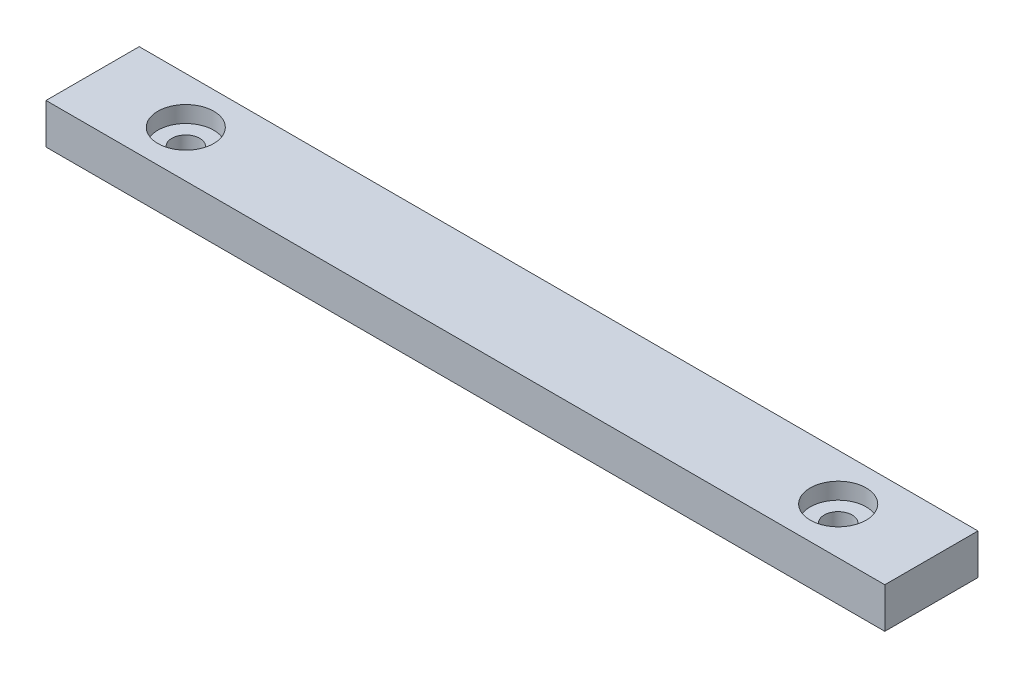
ISO-10303-21;
HEADER;
FILE_DESCRIPTION(('STEP AP214'),'2;1');
FILE_NAME('part.step','',(''),(''),'','','');
FILE_SCHEMA(('AUTOMOTIVE_DESIGN { 1 0 10303 214 1 1 1 1 }'));
ENDSEC;
DATA;
#1=APPLICATION_CONTEXT('core data for automotive mechanical design processes');
#2=APPLICATION_PROTOCOL_DEFINITION('international standard','automotive_design',2000,#1);
#3=PRODUCT_CONTEXT('',#1,'mechanical');
#4=PRODUCT('Part','Part','',(#3));
#5=PRODUCT_RELATED_PRODUCT_CATEGORY('part','',(#4));
#6=PRODUCT_DEFINITION_FORMATION('','',#4);
#7=PRODUCT_DEFINITION_CONTEXT('part definition',#1,'design');
#8=PRODUCT_DEFINITION('design','',#6,#7);
#9=PRODUCT_DEFINITION_SHAPE('','',#8);
#10=(LENGTH_UNIT() NAMED_UNIT(*) SI_UNIT(.MILLI.,.METRE.));
#11=(NAMED_UNIT(*) PLANE_ANGLE_UNIT() SI_UNIT($,.RADIAN.));
#12=(NAMED_UNIT(*) SI_UNIT($,.STERADIAN.) SOLID_ANGLE_UNIT());
#13=UNCERTAINTY_MEASURE_WITH_UNIT(LENGTH_MEASURE(1.E-05),#10,'distance_accuracy_value','');
#14=(GEOMETRIC_REPRESENTATION_CONTEXT(3) GLOBAL_UNCERTAINTY_ASSIGNED_CONTEXT((#13)) GLOBAL_UNIT_ASSIGNED_CONTEXT((#10,
#11,#12)) REPRESENTATION_CONTEXT('',''));
#15=CARTESIAN_POINT('',(0.,0.,0.));
#16=DIRECTION('',(0.,0.,1.));
#17=DIRECTION('',(1.,0.,0.));
#18=AXIS2_PLACEMENT_3D('',#15,#16,#17);
#19=CARTESIAN_POINT('',(135.,13.,15.));
#20=DIRECTION('',(-1.,0.,0.));
#21=DIRECTION('',(0.,0.,1.));
#22=AXIS2_PLACEMENT_3D('',#19,#20,#21);
#23=PLANE('',#22);
#24=DIRECTION('',(0.,0.,-1.));
#25=VECTOR('',#24,1.);
#26=CARTESIAN_POINT('',(135.,0.,15.));
#27=LINE('',#26,#25);
#28=CARTESIAN_POINT('',(135.,0.,15.));
#29=VERTEX_POINT('',#28);
#30=CARTESIAN_POINT('',(135.,0.,-15.));
#31=VERTEX_POINT('',#30);
#32=EDGE_CURVE('E110',#29,#31,#27,.T.);
#33=ORIENTED_EDGE('',*,*,#32,.T.);
#34=DIRECTION('',(0.,-1.,0.));
#35=VECTOR('',#34,1.);
#36=CARTESIAN_POINT('',(135.,13.,-15.));
#37=LINE('',#36,#35);
#38=CARTESIAN_POINT('',(135.,13.,-15.));
#39=VERTEX_POINT('',#38);
#40=EDGE_CURVE('E11',#39,#31,#37,.T.);
#41=ORIENTED_EDGE('',*,*,#40,.F.);
#42=DIRECTION('',(0.,0.,-1.));
#43=VECTOR('',#42,1.);
#44=CARTESIAN_POINT('',(135.,13.,15.));
#45=LINE('',#44,#43);
#46=CARTESIAN_POINT('',(135.,13.,15.));
#47=VERTEX_POINT('',#46);
#48=EDGE_CURVE('E93',#47,#39,#45,.T.);
#49=ORIENTED_EDGE('',*,*,#48,.F.);
#50=DIRECTION('',(0.,-1.,0.));
#51=VECTOR('',#50,1.);
#52=CARTESIAN_POINT('',(135.,13.,15.));
#53=LINE('',#52,#51);
#54=EDGE_CURVE('E106',#47,#29,#53,.T.);
#55=ORIENTED_EDGE('',*,*,#54,.T.);
#56=EDGE_LOOP('',(#33,#41,#49,#55));
#57=FACE_BOUND('',#56,.T.);
#58=ADVANCED_FACE('F39',(#57),#23,.F.);
#59=CARTESIAN_POINT('',(-135.,13.,-15.));
#60=DIRECTION('',(0.,0.,1.));
#61=DIRECTION('',(1.,0.,0.));
#62=AXIS2_PLACEMENT_3D('',#59,#60,#61);
#63=PLANE('',#62);
#64=DIRECTION('',(-1.,0.,0.));
#65=VECTOR('',#64,1.);
#66=CARTESIAN_POINT('',(-135.,0.,-15.));
#67=LINE('',#66,#65);
#68=CARTESIAN_POINT('',(-135.,0.,-15.));
#69=VERTEX_POINT('',#68);
#70=EDGE_CURVE('E98',#31,#69,#67,.T.);
#71=ORIENTED_EDGE('',*,*,#70,.T.);
#72=DIRECTION('',(0.,-1.,0.));
#73=VECTOR('',#72,1.);
#74=CARTESIAN_POINT('',(-135.,13.,-15.));
#75=LINE('',#74,#73);
#76=CARTESIAN_POINT('',(-135.,13.,-15.));
#77=VERTEX_POINT('',#76);
#78=EDGE_CURVE('E49',#77,#69,#75,.T.);
#79=ORIENTED_EDGE('',*,*,#78,.F.);
#80=DIRECTION('',(-1.,0.,0.));
#81=VECTOR('',#80,1.);
#82=CARTESIAN_POINT('',(-135.,13.,-15.));
#83=LINE('',#82,#81);
#84=EDGE_CURVE('E88',#39,#77,#83,.T.);
#85=ORIENTED_EDGE('',*,*,#84,.F.);
#86=ORIENTED_EDGE('',*,*,#40,.T.);
#87=EDGE_LOOP('',(#71,#79,#85,#86));
#88=FACE_BOUND('',#87,.T.);
#89=ADVANCED_FACE('F97',(#88),#63,.F.);
#90=CARTESIAN_POINT('',(-135.,13.,15.));
#91=DIRECTION('',(1.,0.,0.));
#92=DIRECTION('',(0.,0.,-1.));
#93=AXIS2_PLACEMENT_3D('',#90,#91,#92);
#94=PLANE('',#93);
#95=DIRECTION('',(0.,0.,1.));
#96=VECTOR('',#95,1.);
#97=CARTESIAN_POINT('',(-135.,0.,15.));
#98=LINE('',#97,#96);
#99=CARTESIAN_POINT('',(-135.,0.,15.));
#100=VERTEX_POINT('',#99);
#101=EDGE_CURVE('E75',#69,#100,#98,.T.);
#102=ORIENTED_EDGE('',*,*,#101,.T.);
#103=DIRECTION('',(0.,-1.,0.));
#104=VECTOR('',#103,1.);
#105=CARTESIAN_POINT('',(-135.,13.,15.));
#106=LINE('',#105,#104);
#107=CARTESIAN_POINT('',(-135.,13.,15.));
#108=VERTEX_POINT('',#107);
#109=EDGE_CURVE('E100',#108,#100,#106,.T.);
#110=ORIENTED_EDGE('',*,*,#109,.F.);
#111=DIRECTION('',(0.,0.,1.));
#112=VECTOR('',#111,1.);
#113=CARTESIAN_POINT('',(-135.,13.,15.));
#114=LINE('',#113,#112);
#115=EDGE_CURVE('E91',#77,#108,#114,.T.);
#116=ORIENTED_EDGE('',*,*,#115,.F.);
#117=ORIENTED_EDGE('',*,*,#78,.T.);
#118=EDGE_LOOP('',(#102,#110,#116,#117));
#119=FACE_BOUND('',#118,.T.);
#120=ADVANCED_FACE('F102',(#119),#94,.F.);
#121=CARTESIAN_POINT('',(-135.,13.,15.));
#122=DIRECTION('',(0.,0.,-1.));
#123=DIRECTION('',(-1.,0.,0.));
#124=AXIS2_PLACEMENT_3D('',#121,#122,#123);
#125=PLANE('',#124);
#126=DIRECTION('',(1.,0.,0.));
#127=VECTOR('',#126,1.);
#128=CARTESIAN_POINT('',(-135.,0.,15.));
#129=LINE('',#128,#127);
#130=EDGE_CURVE('E81',#100,#29,#129,.T.);
#131=ORIENTED_EDGE('',*,*,#130,.T.);
#132=ORIENTED_EDGE('',*,*,#54,.F.);
#133=DIRECTION('',(1.,0.,0.));
#134=VECTOR('',#133,1.);
#135=CARTESIAN_POINT('',(-135.,13.,15.));
#136=LINE('',#135,#134);
#137=EDGE_CURVE('E58',#108,#47,#136,.T.);
#138=ORIENTED_EDGE('',*,*,#137,.F.);
#139=ORIENTED_EDGE('',*,*,#109,.T.);
#140=EDGE_LOOP('',(#131,#132,#138,#139));
#141=FACE_BOUND('',#140,.T.);
#142=ADVANCED_FACE('F162',(#141),#125,.F.);
#143=CARTESIAN_POINT('',(0.,13.,0.));
#144=DIRECTION('',(0.,-1.,0.));
#145=DIRECTION('',(0.,0.,-1.));
#146=AXIS2_PLACEMENT_3D('',#143,#144,#145);
#147=PLANE('',#146);
#148=CARTESIAN_POINT('',(-105.,13.,0.));
#149=DIRECTION('',(0.,1.,0.));
#150=DIRECTION('',(0.,0.,1.));
#151=AXIS2_PLACEMENT_3D('',#148,#149,#150);
#152=CIRCLE('',#151,9.0055);
#153=CARTESIAN_POINT('',(-105.,13.,9.0055));
#154=VERTEX_POINT('',#153);
#155=EDGE_CURVE('E152',#154,#154,#152,.T.);
#156=ORIENTED_EDGE('',*,*,#155,.F.);
#157=EDGE_LOOP('',(#156));
#158=FACE_BOUND('',#157,.T.);
#159=CARTESIAN_POINT('',(105.,13.,0.));
#160=DIRECTION('',(0.,1.,0.));
#161=DIRECTION('',(0.,0.,1.));
#162=AXIS2_PLACEMENT_3D('',#159,#160,#161);
#163=CIRCLE('',#162,9.0055);
#164=CARTESIAN_POINT('',(105.,13.,9.0055));
#165=VERTEX_POINT('',#164);
#166=EDGE_CURVE('E137',#165,#165,#163,.T.);
#167=ORIENTED_EDGE('',*,*,#166,.F.);
#168=EDGE_LOOP('',(#167));
#169=FACE_BOUND('',#168,.T.);
#170=ORIENTED_EDGE('',*,*,#48,.T.);
#171=ORIENTED_EDGE('',*,*,#84,.T.);
#172=ORIENTED_EDGE('',*,*,#115,.T.);
#173=ORIENTED_EDGE('',*,*,#137,.T.);
#174=EDGE_LOOP('',(#170,#171,#172,#173));
#175=FACE_BOUND('',#174,.T.);
#176=ADVANCED_FACE('F89',(#158,#169,#175),#147,.F.);
#177=CARTESIAN_POINT('',(0.,0.,0.));
#178=DIRECTION('',(0.,-1.,0.));
#179=DIRECTION('',(0.,0.,-1.));
#180=AXIS2_PLACEMENT_3D('',#177,#178,#179);
#181=PLANE('',#180);
#182=CARTESIAN_POINT('',(-105.,0.,0.));
#183=DIRECTION('',(0.,-1.,0.));
#184=DIRECTION('',(0.,0.,-1.));
#185=AXIS2_PLACEMENT_3D('',#182,#183,#184);
#186=CIRCLE('',#185,4.5);
#187=CARTESIAN_POINT('',(-105.,0.,-4.5));
#188=VERTEX_POINT('',#187);
#189=EDGE_CURVE('E42',#188,#188,#186,.T.);
#190=ORIENTED_EDGE('',*,*,#189,.F.);
#191=EDGE_LOOP('',(#190));
#192=FACE_BOUND('',#191,.T.);
#193=CARTESIAN_POINT('',(105.,0.,0.));
#194=DIRECTION('',(0.,-1.,0.));
#195=DIRECTION('',(0.,0.,-1.));
#196=AXIS2_PLACEMENT_3D('',#193,#194,#195);
#197=CIRCLE('',#196,4.5);
#198=CARTESIAN_POINT('',(105.,0.,-4.5));
#199=VERTEX_POINT('',#198);
#200=EDGE_CURVE('E114',#199,#199,#197,.T.);
#201=ORIENTED_EDGE('',*,*,#200,.F.);
#202=EDGE_LOOP('',(#201));
#203=FACE_BOUND('',#202,.T.);
#204=ORIENTED_EDGE('',*,*,#32,.F.);
#205=ORIENTED_EDGE('',*,*,#130,.F.);
#206=ORIENTED_EDGE('',*,*,#101,.F.);
#207=ORIENTED_EDGE('',*,*,#70,.F.);
#208=EDGE_LOOP('',(#204,#205,#206,#207));
#209=FACE_BOUND('',#208,.T.);
#210=ADVANCED_FACE('F161',(#192,#203,#209),#181,.T.);
#211=CARTESIAN_POINT('',(105.,13.,0.));
#212=DIRECTION('',(0.,1.,0.));
#213=DIRECTION('',(0.,0.,1.));
#214=AXIS2_PLACEMENT_3D('',#211,#212,#213);
#215=CYLINDRICAL_SURFACE('',#214,4.5);
#216=ORIENTED_EDGE('',*,*,#200,.T.);
#217=EDGE_LOOP('',(#216));
#218=FACE_BOUND('',#217,.T.);
#219=CARTESIAN_POINT('',(105.,7.7,0.));
#220=DIRECTION('',(0.,1.,0.));
#221=DIRECTION('',(0.,0.,1.));
#222=AXIS2_PLACEMENT_3D('',#219,#220,#221);
#223=CIRCLE('',#222,4.5);
#224=CARTESIAN_POINT('',(105.,7.7,4.5));
#225=VERTEX_POINT('',#224);
#226=EDGE_CURVE('E126',#225,#225,#223,.T.);
#227=ORIENTED_EDGE('',*,*,#226,.T.);
#228=EDGE_LOOP('',(#227));
#229=FACE_BOUND('',#228,.T.);
#230=ADVANCED_FACE('F179',(#218,#229),#215,.F.);
#231=CARTESIAN_POINT('',(109.5,7.7,0.));
#232=DIRECTION('',(0.,-1.,0.));
#233=DIRECTION('',(0.,0.,-1.));
#234=AXIS2_PLACEMENT_3D('',#231,#232,#233);
#235=PLANE('',#234);
#236=ORIENTED_EDGE('',*,*,#226,.F.);
#237=EDGE_LOOP('',(#236));
#238=FACE_BOUND('',#237,.T.);
#239=CARTESIAN_POINT('',(105.,7.7,0.));
#240=DIRECTION('',(0.,1.,0.));
#241=DIRECTION('',(0.,0.,1.));
#242=AXIS2_PLACEMENT_3D('',#239,#240,#241);
#243=CIRCLE('',#242,9.0055);
#244=CARTESIAN_POINT('',(105.,7.7,9.0055));
#245=VERTEX_POINT('',#244);
#246=EDGE_CURVE('E131',#245,#245,#243,.T.);
#247=ORIENTED_EDGE('',*,*,#246,.T.);
#248=EDGE_LOOP('',(#247));
#249=FACE_BOUND('',#248,.T.);
#250=ADVANCED_FACE('F169',(#238,#249),#235,.F.);
#251=CARTESIAN_POINT('',(105.,13.,0.));
#252=DIRECTION('',(0.,1.,0.));
#253=DIRECTION('',(0.,0.,1.));
#254=AXIS2_PLACEMENT_3D('',#251,#252,#253);
#255=CYLINDRICAL_SURFACE('',#254,9.0055);
#256=ORIENTED_EDGE('',*,*,#246,.F.);
#257=EDGE_LOOP('',(#256));
#258=FACE_BOUND('',#257,.T.);
#259=ORIENTED_EDGE('',*,*,#166,.T.);
#260=EDGE_LOOP('',(#259));
#261=FACE_BOUND('',#260,.T.);
#262=ADVANCED_FACE('F166',(#258,#261),#255,.F.);
#263=CARTESIAN_POINT('',(-105.,13.,0.));
#264=DIRECTION('',(0.,1.,0.));
#265=DIRECTION('',(0.,0.,1.));
#266=AXIS2_PLACEMENT_3D('',#263,#264,#265);
#267=CYLINDRICAL_SURFACE('',#266,4.5);
#268=ORIENTED_EDGE('',*,*,#189,.T.);
#269=EDGE_LOOP('',(#268));
#270=FACE_BOUND('',#269,.T.);
#271=CARTESIAN_POINT('',(-105.,7.7,0.));
#272=DIRECTION('',(0.,1.,0.));
#273=DIRECTION('',(0.,0.,1.));
#274=AXIS2_PLACEMENT_3D('',#271,#272,#273);
#275=CIRCLE('',#274,4.5);
#276=CARTESIAN_POINT('',(-105.,7.7,4.5));
#277=VERTEX_POINT('',#276);
#278=EDGE_CURVE('E144',#277,#277,#275,.T.);
#279=ORIENTED_EDGE('',*,*,#278,.T.);
#280=EDGE_LOOP('',(#279));
#281=FACE_BOUND('',#280,.T.);
#282=ADVANCED_FACE('F168',(#270,#281),#267,.F.);
#283=CARTESIAN_POINT('',(-100.5,7.7,0.));
#284=DIRECTION('',(0.,-1.,0.));
#285=DIRECTION('',(0.,0.,-1.));
#286=AXIS2_PLACEMENT_3D('',#283,#284,#285);
#287=PLANE('',#286);
#288=ORIENTED_EDGE('',*,*,#278,.F.);
#289=EDGE_LOOP('',(#288));
#290=FACE_BOUND('',#289,.T.);
#291=CARTESIAN_POINT('',(-105.,7.7,0.));
#292=DIRECTION('',(0.,1.,0.));
#293=DIRECTION('',(0.,0.,1.));
#294=AXIS2_PLACEMENT_3D('',#291,#292,#293);
#295=CIRCLE('',#294,9.0055);
#296=CARTESIAN_POINT('',(-105.,7.7,9.0055));
#297=VERTEX_POINT('',#296);
#298=EDGE_CURVE('E148',#297,#297,#295,.T.);
#299=ORIENTED_EDGE('',*,*,#298,.T.);
#300=EDGE_LOOP('',(#299));
#301=FACE_BOUND('',#300,.T.);
#302=ADVANCED_FACE('F176',(#290,#301),#287,.F.);
#303=CARTESIAN_POINT('',(-105.,13.,0.));
#304=DIRECTION('',(0.,1.,0.));
#305=DIRECTION('',(0.,0.,1.));
#306=AXIS2_PLACEMENT_3D('',#303,#304,#305);
#307=CYLINDRICAL_SURFACE('',#306,9.0055);
#308=ORIENTED_EDGE('',*,*,#298,.F.);
#309=EDGE_LOOP('',(#308));
#310=FACE_BOUND('',#309,.T.);
#311=ORIENTED_EDGE('',*,*,#155,.T.);
#312=EDGE_LOOP('',(#311));
#313=FACE_BOUND('',#312,.T.);
#314=ADVANCED_FACE('F157',(#310,#313),#307,.F.);
#315=CLOSED_SHELL('',(#58,#89,#120,#142,#176,#210,#230,#250,#262,#282,#302,#314));
#316=MANIFOLD_SOLID_BREP('B2',#315);
#317=ADVANCED_BREP_SHAPE_REPRESENTATION('',(#18,#316),#14);
#318=SHAPE_DEFINITION_REPRESENTATION(#9,#317);
ENDSEC;
END-ISO-10303-21;
